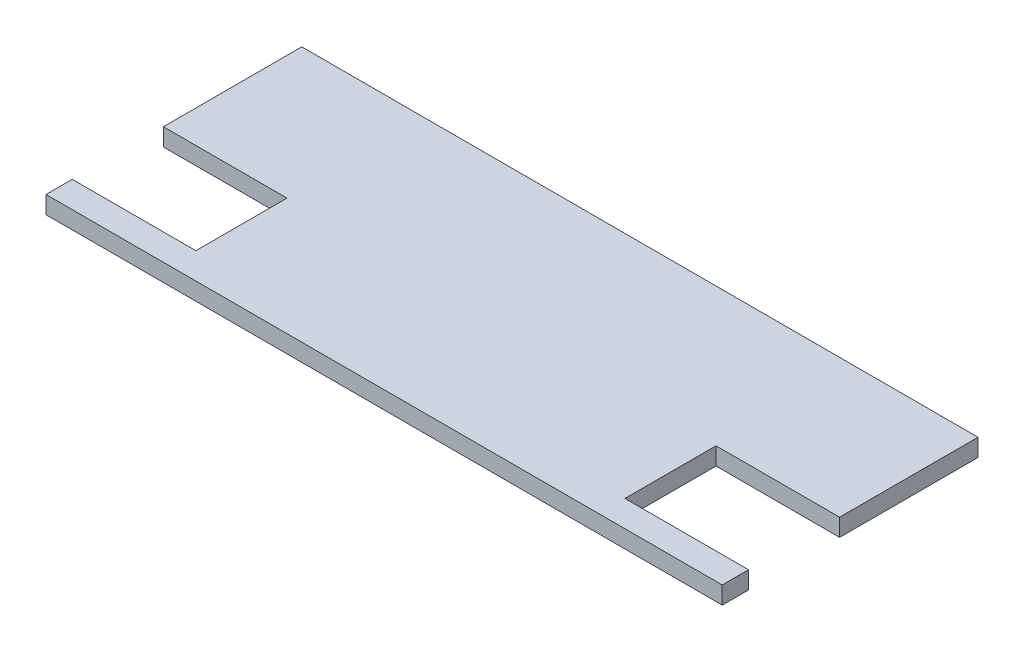
ISO-10303-21;
HEADER;
FILE_DESCRIPTION(('STEP AP214'),'2;1');
FILE_NAME('part.step','',(''),(''),'','','');
FILE_SCHEMA(('AUTOMOTIVE_DESIGN { 1 0 10303 214 1 1 1 1 }'));
ENDSEC;
DATA;
#1=APPLICATION_CONTEXT('core data for automotive mechanical design processes');
#2=APPLICATION_PROTOCOL_DEFINITION('international standard','automotive_design',2000,#1);
#3=PRODUCT_CONTEXT('',#1,'mechanical');
#4=PRODUCT('Part','Part','',(#3));
#5=PRODUCT_RELATED_PRODUCT_CATEGORY('part','',(#4));
#6=PRODUCT_DEFINITION_FORMATION('','',#4);
#7=PRODUCT_DEFINITION_CONTEXT('part definition',#1,'design');
#8=PRODUCT_DEFINITION('design','',#6,#7);
#9=PRODUCT_DEFINITION_SHAPE('','',#8);
#10=(LENGTH_UNIT() NAMED_UNIT(*) SI_UNIT(.MILLI.,.METRE.));
#11=(NAMED_UNIT(*) PLANE_ANGLE_UNIT() SI_UNIT($,.RADIAN.));
#12=(NAMED_UNIT(*) SI_UNIT($,.STERADIAN.) SOLID_ANGLE_UNIT());
#13=UNCERTAINTY_MEASURE_WITH_UNIT(LENGTH_MEASURE(1.E-05),#10,'distance_accuracy_value','');
#14=(GEOMETRIC_REPRESENTATION_CONTEXT(3) GLOBAL_UNCERTAINTY_ASSIGNED_CONTEXT((#13)) GLOBAL_UNIT_ASSIGNED_CONTEXT((#10,
#11,#12)) REPRESENTATION_CONTEXT('',''));
#15=CARTESIAN_POINT('',(0.,0.,0.));
#16=DIRECTION('',(0.,0.,1.));
#17=DIRECTION('',(1.,0.,0.));
#18=AXIS2_PLACEMENT_3D('',#15,#16,#17);
#19=CARTESIAN_POINT('',(0.,5.,29.));
#20=DIRECTION('',(0.,0.,1.));
#21=DIRECTION('',(1.,0.,0.));
#22=AXIS2_PLACEMENT_3D('',#19,#20,#21);
#23=PLANE('',#22);
#24=DIRECTION('',(-1.,0.,0.));
#25=VECTOR('',#24,1.);
#26=CARTESIAN_POINT('',(0.,0.,29.));
#27=LINE('',#26,#25);
#28=CARTESIAN_POINT('',(96.5,0.,29.));
#29=VERTEX_POINT('',#28);
#30=CARTESIAN_POINT('',(61.23,0.,29.));
#31=VERTEX_POINT('',#30);
#32=EDGE_CURVE('E218',#29,#31,#27,.T.);
#33=ORIENTED_EDGE('',*,*,#32,.T.);
#34=DIRECTION('',(0.,-1.,0.));
#35=VECTOR('',#34,1.);
#36=CARTESIAN_POINT('',(61.23,5.,29.));
#37=LINE('',#36,#35);
#38=CARTESIAN_POINT('',(61.23,5.,29.));
#39=VERTEX_POINT('',#38);
#40=EDGE_CURVE('E11',#39,#31,#37,.T.);
#41=ORIENTED_EDGE('',*,*,#40,.F.);
#42=DIRECTION('',(-1.,0.,0.));
#43=VECTOR('',#42,1.);
#44=CARTESIAN_POINT('',(0.,5.,29.));
#45=LINE('',#44,#43);
#46=CARTESIAN_POINT('',(96.5,5.,29.));
#47=VERTEX_POINT('',#46);
#48=EDGE_CURVE('E190',#47,#39,#45,.T.);
#49=ORIENTED_EDGE('',*,*,#48,.F.);
#50=DIRECTION('',(0.,-1.,0.));
#51=VECTOR('',#50,1.);
#52=CARTESIAN_POINT('',(96.5,5.,29.));
#53=LINE('',#52,#51);
#54=EDGE_CURVE('E266',#47,#29,#53,.T.);
#55=ORIENTED_EDGE('',*,*,#54,.T.);
#56=EDGE_LOOP('',(#33,#41,#49,#55));
#57=FACE_BOUND('',#56,.T.);
#58=ADVANCED_FACE('F43',(#57),#23,.F.);
#59=CARTESIAN_POINT('',(61.23,5.,0.));
#60=DIRECTION('',(-1.,0.,0.));
#61=DIRECTION('',(0.,0.,1.));
#62=AXIS2_PLACEMENT_3D('',#59,#60,#61);
#63=PLANE('',#62);
#64=DIRECTION('',(0.,0.,-1.));
#65=VECTOR('',#64,1.);
#66=CARTESIAN_POINT('',(61.23,0.,0.));
#67=LINE('',#66,#65);
#68=CARTESIAN_POINT('',(61.23,0.,3.));
#69=VERTEX_POINT('',#68);
#70=EDGE_CURVE('E213',#31,#69,#67,.T.);
#71=ORIENTED_EDGE('',*,*,#70,.T.);
#72=DIRECTION('',(0.,-1.,0.));
#73=VECTOR('',#72,1.);
#74=CARTESIAN_POINT('',(61.23,5.,3.));
#75=LINE('',#74,#73);
#76=CARTESIAN_POINT('',(61.23,5.,3.));
#77=VERTEX_POINT('',#76);
#78=EDGE_CURVE('E52',#77,#69,#75,.T.);
#79=ORIENTED_EDGE('',*,*,#78,.F.);
#80=DIRECTION('',(0.,0.,-1.));
#81=VECTOR('',#80,1.);
#82=CARTESIAN_POINT('',(61.23,5.,0.));
#83=LINE('',#82,#81);
#84=EDGE_CURVE('E114',#39,#77,#83,.T.);
#85=ORIENTED_EDGE('',*,*,#84,.F.);
#86=ORIENTED_EDGE('',*,*,#40,.T.);
#87=EDGE_LOOP('',(#71,#79,#85,#86));
#88=FACE_BOUND('',#87,.T.);
#89=ADVANCED_FACE('F262',(#88),#63,.F.);
#90=CARTESIAN_POINT('',(0.,5.,3.00000000000002));
#91=DIRECTION('',(0.,0.,1.));
#92=DIRECTION('',(1.,0.,0.));
#93=AXIS2_PLACEMENT_3D('',#90,#91,#92);
#94=PLANE('',#93);
#95=DIRECTION('',(-1.,0.,0.));
#96=VECTOR('',#95,1.);
#97=CARTESIAN_POINT('',(0.,0.,3.00000000000002));
#98=LINE('',#97,#96);
#99=CARTESIAN_POINT('',(96.5,0.,2.99999999999999));
#100=VERTEX_POINT('',#99);
#101=EDGE_CURVE('E204',#100,#69,#98,.T.);
#102=ORIENTED_EDGE('',*,*,#101,.F.);
#103=DIRECTION('',(0.,-1.,0.));
#104=VECTOR('',#103,1.);
#105=CARTESIAN_POINT('',(96.5,5.,2.99999999999999));
#106=LINE('',#105,#104);
#107=CARTESIAN_POINT('',(96.5,5.,2.99999999999999));
#108=VERTEX_POINT('',#107);
#109=EDGE_CURVE('E256',#108,#100,#106,.T.);
#110=ORIENTED_EDGE('',*,*,#109,.F.);
#111=DIRECTION('',(-1.,0.,0.));
#112=VECTOR('',#111,1.);
#113=CARTESIAN_POINT('',(0.,5.,3.00000000000002));
#114=LINE('',#113,#112);
#115=EDGE_CURVE('E182',#108,#77,#114,.T.);
#116=ORIENTED_EDGE('',*,*,#115,.T.);
#117=ORIENTED_EDGE('',*,*,#78,.T.);
#118=EDGE_LOOP('',(#102,#110,#116,#117));
#119=FACE_BOUND('',#118,.T.);
#120=ADVANCED_FACE('F260',(#119),#94,.T.);
#121=CARTESIAN_POINT('',(96.5,5.,0.));
#122=DIRECTION('',(-1.,0.,0.));
#123=DIRECTION('',(0.,0.,1.));
#124=AXIS2_PLACEMENT_3D('',#121,#122,#123);
#125=PLANE('',#124);
#126=DIRECTION('',(0.,0.,-1.));
#127=VECTOR('',#126,1.);
#128=CARTESIAN_POINT('',(96.5,0.,0.));
#129=LINE('',#128,#127);
#130=CARTESIAN_POINT('',(96.5,0.,-36.5));
#131=VERTEX_POINT('',#130);
#132=EDGE_CURVE('E196',#100,#131,#129,.T.);
#133=ORIENTED_EDGE('',*,*,#132,.T.);
#134=DIRECTION('',(0.,-1.,0.));
#135=VECTOR('',#134,1.);
#136=CARTESIAN_POINT('',(96.5,5.,-36.5));
#137=LINE('',#136,#135);
#138=CARTESIAN_POINT('',(96.5,5.,-36.5));
#139=VERTEX_POINT('',#138);
#140=EDGE_CURVE('E253',#139,#131,#137,.T.);
#141=ORIENTED_EDGE('',*,*,#140,.F.);
#142=DIRECTION('',(0.,0.,-1.));
#143=VECTOR('',#142,1.);
#144=CARTESIAN_POINT('',(96.5,5.,0.));
#145=LINE('',#144,#143);
#146=EDGE_CURVE('E178',#108,#139,#145,.T.);
#147=ORIENTED_EDGE('',*,*,#146,.F.);
#148=ORIENTED_EDGE('',*,*,#109,.T.);
#149=EDGE_LOOP('',(#133,#141,#147,#148));
#150=FACE_BOUND('',#149,.T.);
#151=ADVANCED_FACE('F291',(#150),#125,.F.);
#152=CARTESIAN_POINT('',(0.,5.,-36.5));
#153=DIRECTION('',(0.,0.,-1.));
#154=DIRECTION('',(-1.,0.,0.));
#155=AXIS2_PLACEMENT_3D('',#152,#153,#154);
#156=PLANE('',#155);
#157=DIRECTION('',(1.,0.,0.));
#158=VECTOR('',#157,1.);
#159=CARTESIAN_POINT('',(0.,0.,-36.5));
#160=LINE('',#159,#158);
#161=CARTESIAN_POINT('',(-96.5,0.,-36.5));
#162=VERTEX_POINT('',#161);
#163=EDGE_CURVE('E203',#162,#131,#160,.T.);
#164=ORIENTED_EDGE('',*,*,#163,.F.);
#165=DIRECTION('',(0.,-1.,0.));
#166=VECTOR('',#165,1.);
#167=CARTESIAN_POINT('',(-96.5,5.,-36.5));
#168=LINE('',#167,#166);
#169=CARTESIAN_POINT('',(-96.5,5.,-36.5));
#170=VERTEX_POINT('',#169);
#171=EDGE_CURVE('E250',#170,#162,#168,.T.);
#172=ORIENTED_EDGE('',*,*,#171,.F.);
#173=DIRECTION('',(1.,0.,0.));
#174=VECTOR('',#173,1.);
#175=CARTESIAN_POINT('',(0.,5.,-36.5));
#176=LINE('',#175,#174);
#177=EDGE_CURVE('E172',#170,#139,#176,.T.);
#178=ORIENTED_EDGE('',*,*,#177,.T.);
#179=ORIENTED_EDGE('',*,*,#140,.T.);
#180=EDGE_LOOP('',(#164,#172,#178,#179));
#181=FACE_BOUND('',#180,.T.);
#182=ADVANCED_FACE('F289',(#181),#156,.T.);
#183=CARTESIAN_POINT('',(-96.5,5.,0.));
#184=DIRECTION('',(-1.,0.,0.));
#185=DIRECTION('',(0.,0.,1.));
#186=AXIS2_PLACEMENT_3D('',#183,#184,#185);
#187=PLANE('',#186);
#188=DIRECTION('',(0.,0.,-1.));
#189=VECTOR('',#188,1.);
#190=CARTESIAN_POINT('',(-96.5,0.,0.));
#191=LINE('',#190,#189);
#192=CARTESIAN_POINT('',(-96.5,0.,2.99999999999999));
#193=VERTEX_POINT('',#192);
#194=EDGE_CURVE('E211',#193,#162,#191,.T.);
#195=ORIENTED_EDGE('',*,*,#194,.F.);
#196=DIRECTION('',(0.,-1.,0.));
#197=VECTOR('',#196,1.);
#198=CARTESIAN_POINT('',(-96.5,5.,2.99999999999999));
#199=LINE('',#198,#197);
#200=CARTESIAN_POINT('',(-96.5,5.,2.99999999999999));
#201=VERTEX_POINT('',#200);
#202=EDGE_CURVE('E247',#201,#193,#199,.T.);
#203=ORIENTED_EDGE('',*,*,#202,.F.);
#204=DIRECTION('',(0.,0.,-1.));
#205=VECTOR('',#204,1.);
#206=CARTESIAN_POINT('',(-96.5,5.,0.));
#207=LINE('',#206,#205);
#208=EDGE_CURVE('E163',#201,#170,#207,.T.);
#209=ORIENTED_EDGE('',*,*,#208,.T.);
#210=ORIENTED_EDGE('',*,*,#171,.T.);
#211=EDGE_LOOP('',(#195,#203,#209,#210));
#212=FACE_BOUND('',#211,.T.);
#213=ADVANCED_FACE('F287',(#212),#187,.T.);
#214=CARTESIAN_POINT('',(0.,5.,2.99999999999999));
#215=DIRECTION('',(0.,0.,-1.));
#216=DIRECTION('',(-1.,0.,0.));
#217=AXIS2_PLACEMENT_3D('',#214,#215,#216);
#218=PLANE('',#217);
#219=DIRECTION('',(1.,0.,0.));
#220=VECTOR('',#219,1.);
#221=CARTESIAN_POINT('',(0.,0.,2.99999999999999));
#222=LINE('',#221,#220);
#223=CARTESIAN_POINT('',(-61.23,0.,2.99999999999999));
#224=VERTEX_POINT('',#223);
#225=EDGE_CURVE('E278',#193,#224,#222,.T.);
#226=ORIENTED_EDGE('',*,*,#225,.T.);
#227=DIRECTION('',(0.,-1.,0.));
#228=VECTOR('',#227,1.);
#229=CARTESIAN_POINT('',(-61.23,5.,2.99999999999999));
#230=LINE('',#229,#228);
#231=CARTESIAN_POINT('',(-61.23,5.,2.99999999999999));
#232=VERTEX_POINT('',#231);
#233=EDGE_CURVE('E230',#232,#224,#230,.T.);
#234=ORIENTED_EDGE('',*,*,#233,.F.);
#235=DIRECTION('',(1.,0.,0.));
#236=VECTOR('',#235,1.);
#237=CARTESIAN_POINT('',(0.,5.,2.99999999999999));
#238=LINE('',#237,#236);
#239=EDGE_CURVE('E171',#201,#232,#238,.T.);
#240=ORIENTED_EDGE('',*,*,#239,.F.);
#241=ORIENTED_EDGE('',*,*,#202,.T.);
#242=EDGE_LOOP('',(#226,#234,#240,#241));
#243=FACE_BOUND('',#242,.T.);
#244=ADVANCED_FACE('F311',(#243),#218,.F.);
#245=CARTESIAN_POINT('',(-61.23,5.,0.));
#246=DIRECTION('',(-1.,0.,0.));
#247=DIRECTION('',(0.,0.,1.));
#248=AXIS2_PLACEMENT_3D('',#245,#246,#247);
#249=PLANE('',#248);
#250=DIRECTION('',(0.,0.,-1.));
#251=VECTOR('',#250,1.);
#252=CARTESIAN_POINT('',(-61.23,0.,0.));
#253=LINE('',#252,#251);
#254=CARTESIAN_POINT('',(-61.23,0.,29.));
#255=VERTEX_POINT('',#254);
#256=EDGE_CURVE('E274',#255,#224,#253,.T.);
#257=ORIENTED_EDGE('',*,*,#256,.F.);
#258=DIRECTION('',(0.,-1.,0.));
#259=VECTOR('',#258,1.);
#260=CARTESIAN_POINT('',(-61.23,5.,29.));
#261=LINE('',#260,#259);
#262=CARTESIAN_POINT('',(-61.23,5.,29.));
#263=VERTEX_POINT('',#262);
#264=EDGE_CURVE('E232',#263,#255,#261,.T.);
#265=ORIENTED_EDGE('',*,*,#264,.F.);
#266=DIRECTION('',(0.,0.,-1.));
#267=VECTOR('',#266,1.);
#268=CARTESIAN_POINT('',(-61.23,5.,0.));
#269=LINE('',#268,#267);
#270=EDGE_CURVE('E165',#263,#232,#269,.T.);
#271=ORIENTED_EDGE('',*,*,#270,.T.);
#272=ORIENTED_EDGE('',*,*,#233,.T.);
#273=EDGE_LOOP('',(#257,#265,#271,#272));
#274=FACE_BOUND('',#273,.T.);
#275=ADVANCED_FACE('F228',(#274),#249,.T.);
#276=CARTESIAN_POINT('',(0.,5.,29.));
#277=DIRECTION('',(0.,0.,-1.));
#278=DIRECTION('',(-1.,0.,0.));
#279=AXIS2_PLACEMENT_3D('',#276,#277,#278);
#280=PLANE('',#279);
#281=DIRECTION('',(1.,0.,0.));
#282=VECTOR('',#281,1.);
#283=CARTESIAN_POINT('',(0.,0.,29.));
#284=LINE('',#283,#282);
#285=CARTESIAN_POINT('',(-96.5,0.,29.));
#286=VERTEX_POINT('',#285);
#287=EDGE_CURVE('E238',#286,#255,#284,.T.);
#288=ORIENTED_EDGE('',*,*,#287,.F.);
#289=DIRECTION('',(0.,-1.,0.));
#290=VECTOR('',#289,1.);
#291=CARTESIAN_POINT('',(-96.5,5.,29.));
#292=LINE('',#291,#290);
#293=CARTESIAN_POINT('',(-96.5,5.,29.));
#294=VERTEX_POINT('',#293);
#295=EDGE_CURVE('E149',#294,#286,#292,.T.);
#296=ORIENTED_EDGE('',*,*,#295,.F.);
#297=DIRECTION('',(1.,0.,0.));
#298=VECTOR('',#297,1.);
#299=CARTESIAN_POINT('',(0.,5.,29.));
#300=LINE('',#299,#298);
#301=EDGE_CURVE('E160',#294,#263,#300,.T.);
#302=ORIENTED_EDGE('',*,*,#301,.T.);
#303=ORIENTED_EDGE('',*,*,#264,.T.);
#304=EDGE_LOOP('',(#288,#296,#302,#303));
#305=FACE_BOUND('',#304,.T.);
#306=ADVANCED_FACE('F236',(#305),#280,.T.);
#307=CARTESIAN_POINT('',(-96.5,0.,36.5));
#308=VERTEX_POINT('',#307);
#309=EDGE_CURVE('E147',#308,#286,#191,.T.);
#310=ORIENTED_EDGE('',*,*,#309,.F.);
#311=DIRECTION('',(0.,-1.,0.));
#312=VECTOR('',#311,1.);
#313=CARTESIAN_POINT('',(-96.5,5.,36.5));
#314=LINE('',#313,#312);
#315=CARTESIAN_POINT('',(-96.5,5.,36.5));
#316=VERTEX_POINT('',#315);
#317=EDGE_CURVE('E141',#316,#308,#314,.T.);
#318=ORIENTED_EDGE('',*,*,#317,.F.);
#319=EDGE_CURVE('E145',#316,#294,#207,.T.);
#320=ORIENTED_EDGE('',*,*,#319,.T.);
#321=ORIENTED_EDGE('',*,*,#295,.T.);
#322=EDGE_LOOP('',(#310,#318,#320,#321));
#323=FACE_BOUND('',#322,.T.);
#324=ADVANCED_FACE('F143',(#323),#187,.T.);
#325=CARTESIAN_POINT('',(0.,5.,36.5));
#326=DIRECTION('',(0.,0.,-1.));
#327=DIRECTION('',(-1.,0.,0.));
#328=AXIS2_PLACEMENT_3D('',#325,#326,#327);
#329=PLANE('',#328);
#330=DIRECTION('',(1.,0.,0.));
#331=VECTOR('',#330,1.);
#332=CARTESIAN_POINT('',(0.,0.,36.5));
#333=LINE('',#332,#331);
#334=CARTESIAN_POINT('',(96.5,0.,36.5));
#335=VERTEX_POINT('',#334);
#336=EDGE_CURVE('E100',#308,#335,#333,.T.);
#337=ORIENTED_EDGE('',*,*,#336,.T.);
#338=DIRECTION('',(0.,-1.,0.));
#339=VECTOR('',#338,1.);
#340=CARTESIAN_POINT('',(96.5,5.,36.5));
#341=LINE('',#340,#339);
#342=CARTESIAN_POINT('',(96.5,5.,36.5));
#343=VERTEX_POINT('',#342);
#344=EDGE_CURVE('E150',#343,#335,#341,.T.);
#345=ORIENTED_EDGE('',*,*,#344,.F.);
#346=DIRECTION('',(1.,0.,0.));
#347=VECTOR('',#346,1.);
#348=CARTESIAN_POINT('',(0.,5.,36.5));
#349=LINE('',#348,#347);
#350=EDGE_CURVE('E152',#316,#343,#349,.T.);
#351=ORIENTED_EDGE('',*,*,#350,.F.);
#352=ORIENTED_EDGE('',*,*,#317,.T.);
#353=EDGE_LOOP('',(#337,#345,#351,#352));
#354=FACE_BOUND('',#353,.T.);
#355=ADVANCED_FACE('F153',(#354),#329,.F.);
#356=EDGE_CURVE('E106',#335,#29,#129,.T.);
#357=ORIENTED_EDGE('',*,*,#356,.T.);
#358=ORIENTED_EDGE('',*,*,#54,.F.);
#359=EDGE_CURVE('E60',#343,#47,#145,.T.);
#360=ORIENTED_EDGE('',*,*,#359,.F.);
#361=ORIENTED_EDGE('',*,*,#344,.T.);
#362=EDGE_LOOP('',(#357,#358,#360,#361));
#363=FACE_BOUND('',#362,.T.);
#364=ADVANCED_FACE('F294',(#363),#125,.F.);
#365=CARTESIAN_POINT('',(0.,5.,0.));
#366=DIRECTION('',(0.,1.,0.));
#367=DIRECTION('',(0.,0.,1.));
#368=AXIS2_PLACEMENT_3D('',#365,#366,#367);
#369=PLANE('',#368);
#370=ORIENTED_EDGE('',*,*,#48,.T.);
#371=ORIENTED_EDGE('',*,*,#84,.T.);
#372=ORIENTED_EDGE('',*,*,#115,.F.);
#373=ORIENTED_EDGE('',*,*,#146,.T.);
#374=ORIENTED_EDGE('',*,*,#177,.F.);
#375=ORIENTED_EDGE('',*,*,#208,.F.);
#376=ORIENTED_EDGE('',*,*,#239,.T.);
#377=ORIENTED_EDGE('',*,*,#270,.F.);
#378=ORIENTED_EDGE('',*,*,#301,.F.);
#379=ORIENTED_EDGE('',*,*,#319,.F.);
#380=ORIENTED_EDGE('',*,*,#350,.T.);
#381=ORIENTED_EDGE('',*,*,#359,.T.);
#382=EDGE_LOOP('',(#370,#371,#372,#373,#374,#375,#376,#377,#378,#379,#380,#381));
#383=FACE_BOUND('',#382,.T.);
#384=ADVANCED_FACE('F157',(#383),#369,.T.);
#385=CARTESIAN_POINT('',(0.,0.,0.));
#386=DIRECTION('',(0.,1.,0.));
#387=DIRECTION('',(0.,0.,1.));
#388=AXIS2_PLACEMENT_3D('',#385,#386,#387);
#389=PLANE('',#388);
#390=ORIENTED_EDGE('',*,*,#32,.F.);
#391=ORIENTED_EDGE('',*,*,#356,.F.);
#392=ORIENTED_EDGE('',*,*,#336,.F.);
#393=ORIENTED_EDGE('',*,*,#309,.T.);
#394=ORIENTED_EDGE('',*,*,#287,.T.);
#395=ORIENTED_EDGE('',*,*,#256,.T.);
#396=ORIENTED_EDGE('',*,*,#225,.F.);
#397=ORIENTED_EDGE('',*,*,#194,.T.);
#398=ORIENTED_EDGE('',*,*,#163,.T.);
#399=ORIENTED_EDGE('',*,*,#132,.F.);
#400=ORIENTED_EDGE('',*,*,#101,.T.);
#401=ORIENTED_EDGE('',*,*,#70,.F.);
#402=EDGE_LOOP('',(#390,#391,#392,#393,#394,#395,#396,#397,#398,#399,#400,#401));
#403=FACE_BOUND('',#402,.T.);
#404=ADVANCED_FACE('F264',(#403),#389,.F.);
#405=CLOSED_SHELL('',(#58,#89,#120,#151,#182,#213,#244,#275,#306,#324,#355,#364,#384,#404));
#406=MANIFOLD_SOLID_BREP('B2',#405);
#407=ADVANCED_BREP_SHAPE_REPRESENTATION('',(#18,#406),#14);
#408=SHAPE_DEFINITION_REPRESENTATION(#9,#407);
ENDSEC;
END-ISO-10303-21;
